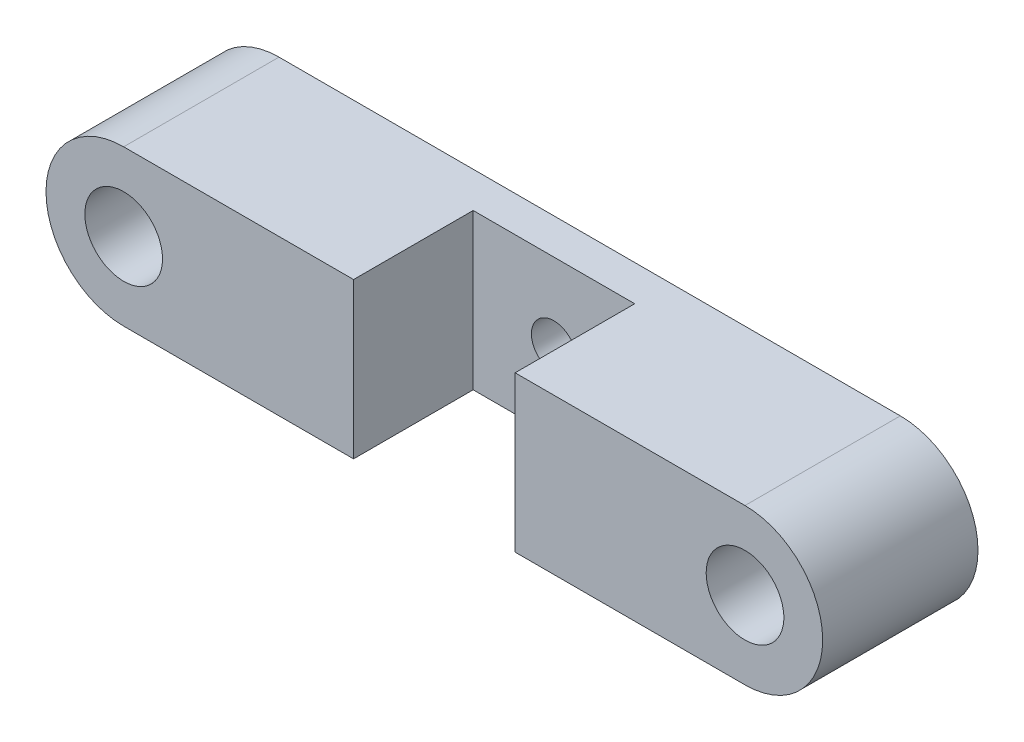
ISO-10303-21;
HEADER;
FILE_DESCRIPTION(('STEP AP214'),'2;1');
FILE_NAME('part.step','',(''),(''),'','','');
FILE_SCHEMA(('AUTOMOTIVE_DESIGN { 1 0 10303 214 1 1 1 1 }'));
ENDSEC;
DATA;
#1=APPLICATION_CONTEXT('core data for automotive mechanical design processes');
#2=APPLICATION_PROTOCOL_DEFINITION('international standard','automotive_design',2000,#1);
#3=PRODUCT_CONTEXT('',#1,'mechanical');
#4=PRODUCT('Part','Part','',(#3));
#5=PRODUCT_RELATED_PRODUCT_CATEGORY('part','',(#4));
#6=PRODUCT_DEFINITION_FORMATION('','',#4);
#7=PRODUCT_DEFINITION_CONTEXT('part definition',#1,'design');
#8=PRODUCT_DEFINITION('design','',#6,#7);
#9=PRODUCT_DEFINITION_SHAPE('','',#8);
#10=(LENGTH_UNIT() NAMED_UNIT(*) SI_UNIT(.MILLI.,.METRE.));
#11=(NAMED_UNIT(*) PLANE_ANGLE_UNIT() SI_UNIT($,.RADIAN.));
#12=(NAMED_UNIT(*) SI_UNIT($,.STERADIAN.) SOLID_ANGLE_UNIT());
#13=UNCERTAINTY_MEASURE_WITH_UNIT(LENGTH_MEASURE(1.E-05),#10,'distance_accuracy_value','');
#14=(GEOMETRIC_REPRESENTATION_CONTEXT(3) GLOBAL_UNCERTAINTY_ASSIGNED_CONTEXT((#13)) GLOBAL_UNIT_ASSIGNED_CONTEXT((#10,
#11,#12)) REPRESENTATION_CONTEXT('',''));
#15=CARTESIAN_POINT('',(0.,0.,0.));
#16=DIRECTION('',(0.,0.,1.));
#17=DIRECTION('',(1.,0.,0.));
#18=AXIS2_PLACEMENT_3D('',#15,#16,#17);
#19=CARTESIAN_POINT('',(-50.8,0.,25.4));
#20=DIRECTION('',(0.,0.,1.));
#21=DIRECTION('',(1.,0.,0.));
#22=AXIS2_PLACEMENT_3D('',#19,#20,#21);
#23=PLANE('',#22);
#24=DIRECTION('',(0.,1.,0.));
#25=VECTOR('',#24,1.);
#26=CARTESIAN_POINT('',(13.208,0.,25.4));
#27=LINE('',#26,#25);
#28=CARTESIAN_POINT('',(13.208,-12.7,25.4));
#29=VERTEX_POINT('',#28);
#30=CARTESIAN_POINT('',(13.208,12.7,25.4));
#31=VERTEX_POINT('',#30);
#32=EDGE_CURVE('E138',#29,#31,#27,.T.);
#33=ORIENTED_EDGE('',*,*,#32,.F.);
#34=DIRECTION('',(1.,0.,0.));
#35=VECTOR('',#34,1.);
#36=CARTESIAN_POINT('',(-50.8,-12.7,25.4));
#37=LINE('',#36,#35);
#38=CARTESIAN_POINT('',(50.8,-12.7,25.4));
#39=VERTEX_POINT('',#38);
#40=EDGE_CURVE('E155',#29,#39,#37,.T.);
#41=ORIENTED_EDGE('',*,*,#40,.T.);
#42=CARTESIAN_POINT('',(50.8,0.,25.4));
#43=DIRECTION('',(0.,0.,1.));
#44=DIRECTION('',(1.,0.,0.));
#45=AXIS2_PLACEMENT_3D('',#42,#43,#44);
#46=CIRCLE('',#45,12.7);
#47=CARTESIAN_POINT('',(50.8,12.7,25.4));
#48=VERTEX_POINT('',#47);
#49=EDGE_CURVE('E157',#39,#48,#46,.T.);
#50=ORIENTED_EDGE('',*,*,#49,.T.);
#51=DIRECTION('',(-1.,0.,0.));
#52=VECTOR('',#51,1.);
#53=CARTESIAN_POINT('',(-50.8,12.7,25.4));
#54=LINE('',#53,#52);
#55=EDGE_CURVE('E159',#48,#31,#54,.T.);
#56=ORIENTED_EDGE('',*,*,#55,.T.);
#57=EDGE_LOOP('',(#33,#41,#50,#56));
#58=FACE_BOUND('',#57,.T.);
#59=CARTESIAN_POINT('',(50.8,0.,25.4));
#60=DIRECTION('',(0.,0.,1.));
#61=DIRECTION('',(-1.,0.,0.));
#62=AXIS2_PLACEMENT_3D('',#59,#60,#61);
#63=CIRCLE('',#62,6.35);
#64=CARTESIAN_POINT('',(44.45,0.,25.4));
#65=VERTEX_POINT('',#64);
#66=EDGE_CURVE('E141',#65,#65,#63,.T.);
#67=ORIENTED_EDGE('',*,*,#66,.F.);
#68=EDGE_LOOP('',(#67));
#69=FACE_BOUND('',#68,.T.);
#70=ADVANCED_FACE('F33',(#58,#69),#23,.T.);
#71=DIRECTION('',(0.,-1.,0.));
#72=VECTOR('',#71,1.);
#73=CARTESIAN_POINT('',(-13.208,0.,25.4));
#74=LINE('',#73,#72);
#75=CARTESIAN_POINT('',(-13.208,12.7,25.4));
#76=VERTEX_POINT('',#75);
#77=CARTESIAN_POINT('',(-13.208,-12.7,25.4));
#78=VERTEX_POINT('',#77);
#79=EDGE_CURVE('E122',#76,#78,#74,.T.);
#80=ORIENTED_EDGE('',*,*,#79,.F.);
#81=CARTESIAN_POINT('',(-50.8,12.7,25.4));
#82=VERTEX_POINT('',#81);
#83=EDGE_CURVE('E57',#76,#82,#54,.T.);
#84=ORIENTED_EDGE('',*,*,#83,.T.);
#85=CARTESIAN_POINT('',(-50.8,0.,25.4));
#86=DIRECTION('',(0.,0.,1.));
#87=DIRECTION('',(1.,0.,0.));
#88=AXIS2_PLACEMENT_3D('',#85,#86,#87);
#89=CIRCLE('',#88,12.7);
#90=CARTESIAN_POINT('',(-50.8,-12.7,25.4));
#91=VERTEX_POINT('',#90);
#92=EDGE_CURVE('E153',#82,#91,#89,.T.);
#93=ORIENTED_EDGE('',*,*,#92,.T.);
#94=EDGE_CURVE('E87',#91,#78,#37,.T.);
#95=ORIENTED_EDGE('',*,*,#94,.T.);
#96=EDGE_LOOP('',(#80,#84,#93,#95));
#97=FACE_BOUND('',#96,.T.);
#98=CARTESIAN_POINT('',(-50.8,0.,25.4));
#99=DIRECTION('',(0.,0.,1.));
#100=DIRECTION('',(1.,0.,0.));
#101=AXIS2_PLACEMENT_3D('',#98,#99,#100);
#102=CIRCLE('',#101,6.35);
#103=CARTESIAN_POINT('',(-44.45,0.,25.4));
#104=VERTEX_POINT('',#103);
#105=EDGE_CURVE('E147',#104,#104,#102,.T.);
#106=ORIENTED_EDGE('',*,*,#105,.F.);
#107=EDGE_LOOP('',(#106));
#108=FACE_BOUND('',#107,.T.);
#109=ADVANCED_FACE('F195',(#97,#108),#23,.T.);
#110=CARTESIAN_POINT('',(-50.8,0.,0.));
#111=DIRECTION('',(0.,0.,1.));
#112=DIRECTION('',(1.,0.,0.));
#113=AXIS2_PLACEMENT_3D('',#110,#111,#112);
#114=PLANE('',#113);
#115=CARTESIAN_POINT('',(0.,0.,0.));
#116=DIRECTION('',(0.,0.,1.));
#117=DIRECTION('',(1.,0.,0.));
#118=AXIS2_PLACEMENT_3D('',#115,#116,#117);
#119=CIRCLE('',#118,3.683);
#120=CARTESIAN_POINT('',(3.683,0.,0.));
#121=VERTEX_POINT('',#120);
#122=EDGE_CURVE('E134',#121,#121,#119,.T.);
#123=ORIENTED_EDGE('',*,*,#122,.T.);
#124=EDGE_LOOP('',(#123));
#125=FACE_BOUND('',#124,.T.);
#126=CARTESIAN_POINT('',(-50.8,0.,0.));
#127=DIRECTION('',(0.,0.,1.));
#128=DIRECTION('',(1.,0.,0.));
#129=AXIS2_PLACEMENT_3D('',#126,#127,#128);
#130=CIRCLE('',#129,12.7);
#131=CARTESIAN_POINT('',(-50.8,12.7,0.));
#132=VERTEX_POINT('',#131);
#133=CARTESIAN_POINT('',(-50.8,-12.7,0.));
#134=VERTEX_POINT('',#133);
#135=EDGE_CURVE('E150',#132,#134,#130,.T.);
#136=ORIENTED_EDGE('',*,*,#135,.F.);
#137=DIRECTION('',(-1.,0.,0.));
#138=VECTOR('',#137,1.);
#139=CARTESIAN_POINT('',(-50.8,12.7,0.));
#140=LINE('',#139,#138);
#141=CARTESIAN_POINT('',(50.8,12.7,0.));
#142=VERTEX_POINT('',#141);
#143=EDGE_CURVE('E79',#142,#132,#140,.T.);
#144=ORIENTED_EDGE('',*,*,#143,.F.);
#145=CARTESIAN_POINT('',(50.8,0.,0.));
#146=DIRECTION('',(0.,0.,1.));
#147=DIRECTION('',(1.,0.,0.));
#148=AXIS2_PLACEMENT_3D('',#145,#146,#147);
#149=CIRCLE('',#148,12.7);
#150=CARTESIAN_POINT('',(50.8,-12.7,0.));
#151=VERTEX_POINT('',#150);
#152=EDGE_CURVE('E167',#151,#142,#149,.T.);
#153=ORIENTED_EDGE('',*,*,#152,.F.);
#154=DIRECTION('',(1.,0.,0.));
#155=VECTOR('',#154,1.);
#156=CARTESIAN_POINT('',(-50.8,-12.7,0.));
#157=LINE('',#156,#155);
#158=EDGE_CURVE('E165',#134,#151,#157,.T.);
#159=ORIENTED_EDGE('',*,*,#158,.F.);
#160=EDGE_LOOP('',(#136,#144,#153,#159));
#161=FACE_BOUND('',#160,.T.);
#162=CARTESIAN_POINT('',(-50.8,0.,0.));
#163=DIRECTION('',(0.,0.,1.));
#164=DIRECTION('',(1.,0.,0.));
#165=AXIS2_PLACEMENT_3D('',#162,#163,#164);
#166=CIRCLE('',#165,6.35);
#167=CARTESIAN_POINT('',(-44.45,0.,0.));
#168=VERTEX_POINT('',#167);
#169=EDGE_CURVE('E144',#168,#168,#166,.T.);
#170=ORIENTED_EDGE('',*,*,#169,.T.);
#171=EDGE_LOOP('',(#170));
#172=FACE_BOUND('',#171,.T.);
#173=CARTESIAN_POINT('',(50.8,0.,0.));
#174=DIRECTION('',(0.,0.,1.));
#175=DIRECTION('',(-1.,0.,0.));
#176=AXIS2_PLACEMENT_3D('',#173,#174,#175);
#177=CIRCLE('',#176,6.35);
#178=CARTESIAN_POINT('',(44.45,0.,0.));
#179=VERTEX_POINT('',#178);
#180=EDGE_CURVE('E140',#179,#179,#177,.T.);
#181=ORIENTED_EDGE('',*,*,#180,.T.);
#182=EDGE_LOOP('',(#181));
#183=FACE_BOUND('',#182,.T.);
#184=ADVANCED_FACE('F181',(#125,#161,#172,#183),#114,.F.);
#185=CARTESIAN_POINT('',(-50.8,0.,25.4));
#186=DIRECTION('',(0.,0.,-1.));
#187=DIRECTION('',(-1.,0.,0.));
#188=AXIS2_PLACEMENT_3D('',#185,#186,#187);
#189=CYLINDRICAL_SURFACE('',#188,12.7);
#190=ORIENTED_EDGE('',*,*,#135,.T.);
#191=DIRECTION('',(0.,0.,-1.));
#192=VECTOR('',#191,1.);
#193=CARTESIAN_POINT('',(-50.8,-12.7,25.4));
#194=LINE('',#193,#192);
#195=EDGE_CURVE('E41',#91,#134,#194,.T.);
#196=ORIENTED_EDGE('',*,*,#195,.F.);
#197=ORIENTED_EDGE('',*,*,#92,.F.);
#198=DIRECTION('',(0.,0.,-1.));
#199=VECTOR('',#198,1.);
#200=CARTESIAN_POINT('',(-50.8,12.7,25.4));
#201=LINE('',#200,#199);
#202=EDGE_CURVE('E162',#82,#132,#201,.T.);
#203=ORIENTED_EDGE('',*,*,#202,.T.);
#204=EDGE_LOOP('',(#190,#196,#197,#203));
#205=FACE_BOUND('',#204,.T.);
#206=ADVANCED_FACE('F35',(#205),#189,.T.);
#207=CARTESIAN_POINT('',(-50.8,-12.7,25.4));
#208=DIRECTION('',(0.,1.,0.));
#209=DIRECTION('',(-1.,0.,0.));
#210=AXIS2_PLACEMENT_3D('',#207,#208,#209);
#211=PLANE('',#210);
#212=ORIENTED_EDGE('',*,*,#40,.F.);
#213=DIRECTION('',(0.,0.,-1.));
#214=VECTOR('',#213,1.);
#215=CARTESIAN_POINT('',(13.208,-12.7,5.842));
#216=LINE('',#215,#214);
#217=CARTESIAN_POINT('',(13.208,-12.7,5.842));
#218=VERTEX_POINT('',#217);
#219=EDGE_CURVE('E118',#29,#218,#216,.T.);
#220=ORIENTED_EDGE('',*,*,#219,.T.);
#221=DIRECTION('',(-1.,0.,0.));
#222=VECTOR('',#221,1.);
#223=CARTESIAN_POINT('',(-13.208,-12.7,5.842));
#224=LINE('',#223,#222);
#225=CARTESIAN_POINT('',(-13.208,-12.7,5.842));
#226=VERTEX_POINT('',#225);
#227=EDGE_CURVE('E113',#218,#226,#224,.T.);
#228=ORIENTED_EDGE('',*,*,#227,.T.);
#229=DIRECTION('',(0.,0.,1.));
#230=VECTOR('',#229,1.);
#231=CARTESIAN_POINT('',(-13.208,-12.7,5.842));
#232=LINE('',#231,#230);
#233=EDGE_CURVE('E120',#226,#78,#232,.T.);
#234=ORIENTED_EDGE('',*,*,#233,.T.);
#235=ORIENTED_EDGE('',*,*,#94,.F.);
#236=ORIENTED_EDGE('',*,*,#195,.T.);
#237=ORIENTED_EDGE('',*,*,#158,.T.);
#238=DIRECTION('',(0.,0.,-1.));
#239=VECTOR('',#238,1.);
#240=CARTESIAN_POINT('',(50.8,-12.7,25.4));
#241=LINE('',#240,#239);
#242=EDGE_CURVE('E173',#39,#151,#241,.T.);
#243=ORIENTED_EDGE('',*,*,#242,.F.);
#244=EDGE_LOOP('',(#212,#220,#228,#234,#235,#236,#237,#243));
#245=FACE_BOUND('',#244,.T.);
#246=ADVANCED_FACE('F125',(#245),#211,.F.);
#247=CARTESIAN_POINT('',(50.8,0.,25.4));
#248=DIRECTION('',(0.,0.,-1.));
#249=DIRECTION('',(-1.,0.,0.));
#250=AXIS2_PLACEMENT_3D('',#247,#248,#249);
#251=CYLINDRICAL_SURFACE('',#250,12.7);
#252=ORIENTED_EDGE('',*,*,#152,.T.);
#253=DIRECTION('',(0.,0.,-1.));
#254=VECTOR('',#253,1.);
#255=CARTESIAN_POINT('',(50.8,12.7,25.4));
#256=LINE('',#255,#254);
#257=EDGE_CURVE('E171',#48,#142,#256,.T.);
#258=ORIENTED_EDGE('',*,*,#257,.F.);
#259=ORIENTED_EDGE('',*,*,#49,.F.);
#260=ORIENTED_EDGE('',*,*,#242,.T.);
#261=EDGE_LOOP('',(#252,#258,#259,#260));
#262=FACE_BOUND('',#261,.T.);
#263=ADVANCED_FACE('F186',(#262),#251,.T.);
#264=CARTESIAN_POINT('',(-50.8,12.7,25.4));
#265=DIRECTION('',(0.,-1.,0.));
#266=DIRECTION('',(1.,0.,0.));
#267=AXIS2_PLACEMENT_3D('',#264,#265,#266);
#268=PLANE('',#267);
#269=DIRECTION('',(-1.,0.,0.));
#270=VECTOR('',#269,1.);
#271=CARTESIAN_POINT('',(-13.208,12.7,5.842));
#272=LINE('',#271,#270);
#273=CARTESIAN_POINT('',(13.208,12.7,5.842));
#274=VERTEX_POINT('',#273);
#275=CARTESIAN_POINT('',(-13.208,12.7,5.842));
#276=VERTEX_POINT('',#275);
#277=EDGE_CURVE('E48',#274,#276,#272,.T.);
#278=ORIENTED_EDGE('',*,*,#277,.F.);
#279=DIRECTION('',(0.,0.,1.));
#280=VECTOR('',#279,1.);
#281=CARTESIAN_POINT('',(13.208,12.7,25.4));
#282=LINE('',#281,#280);
#283=EDGE_CURVE('E11',#274,#31,#282,.T.);
#284=ORIENTED_EDGE('',*,*,#283,.T.);
#285=ORIENTED_EDGE('',*,*,#55,.F.);
#286=ORIENTED_EDGE('',*,*,#257,.T.);
#287=ORIENTED_EDGE('',*,*,#143,.T.);
#288=ORIENTED_EDGE('',*,*,#202,.F.);
#289=ORIENTED_EDGE('',*,*,#83,.F.);
#290=DIRECTION('',(0.,0.,1.));
#291=VECTOR('',#290,1.);
#292=CARTESIAN_POINT('',(-13.208,12.7,5.842));
#293=LINE('',#292,#291);
#294=EDGE_CURVE('E126',#276,#76,#293,.T.);
#295=ORIENTED_EDGE('',*,*,#294,.F.);
#296=EDGE_LOOP('',(#278,#284,#285,#286,#287,#288,#289,#295));
#297=FACE_BOUND('',#296,.T.);
#298=ADVANCED_FACE('F189',(#297),#268,.F.);
#299=CARTESIAN_POINT('',(-50.8,0.,25.4));
#300=DIRECTION('',(0.,0.,-1.));
#301=DIRECTION('',(-1.,0.,0.));
#302=AXIS2_PLACEMENT_3D('',#299,#300,#301);
#303=CYLINDRICAL_SURFACE('',#302,6.35);
#304=ORIENTED_EDGE('',*,*,#105,.T.);
#305=EDGE_LOOP('',(#304));
#306=FACE_BOUND('',#305,.T.);
#307=ORIENTED_EDGE('',*,*,#169,.F.);
#308=EDGE_LOOP('',(#307));
#309=FACE_BOUND('',#308,.T.);
#310=ADVANCED_FACE('F201',(#306,#309),#303,.F.);
#311=CARTESIAN_POINT('',(50.8,0.,25.4));
#312=DIRECTION('',(0.,0.,-1.));
#313=DIRECTION('',(-1.,0.,0.));
#314=AXIS2_PLACEMENT_3D('',#311,#312,#313);
#315=CYLINDRICAL_SURFACE('',#314,6.35);
#316=ORIENTED_EDGE('',*,*,#66,.T.);
#317=EDGE_LOOP('',(#316));
#318=FACE_BOUND('',#317,.T.);
#319=ORIENTED_EDGE('',*,*,#180,.F.);
#320=EDGE_LOOP('',(#319));
#321=FACE_BOUND('',#320,.T.);
#322=ADVANCED_FACE('F204',(#318,#321),#315,.F.);
#323=CARTESIAN_POINT('',(-13.208,-12.7,5.842));
#324=DIRECTION('',(0.,0.,-1.));
#325=DIRECTION('',(-1.,0.,0.));
#326=AXIS2_PLACEMENT_3D('',#323,#324,#325);
#327=PLANE('',#326);
#328=CARTESIAN_POINT('',(0.,0.,5.842));
#329=DIRECTION('',(0.,0.,1.));
#330=DIRECTION('',(1.,0.,0.));
#331=AXIS2_PLACEMENT_3D('',#328,#329,#330);
#332=CIRCLE('',#331,3.683);
#333=CARTESIAN_POINT('',(3.683,0.,5.842));
#334=VERTEX_POINT('',#333);
#335=EDGE_CURVE('E130',#334,#334,#332,.T.);
#336=ORIENTED_EDGE('',*,*,#335,.F.);
#337=EDGE_LOOP('',(#336));
#338=FACE_BOUND('',#337,.T.);
#339=ORIENTED_EDGE('',*,*,#277,.T.);
#340=DIRECTION('',(0.,1.,0.));
#341=VECTOR('',#340,1.);
#342=CARTESIAN_POINT('',(-13.208,-12.7,5.842));
#343=LINE('',#342,#341);
#344=EDGE_CURVE('E109',#226,#276,#343,.T.);
#345=ORIENTED_EDGE('',*,*,#344,.F.);
#346=ORIENTED_EDGE('',*,*,#227,.F.);
#347=DIRECTION('',(0.,1.,0.));
#348=VECTOR('',#347,1.);
#349=CARTESIAN_POINT('',(13.208,-12.7,5.842));
#350=LINE('',#349,#348);
#351=EDGE_CURVE('E117',#218,#274,#350,.T.);
#352=ORIENTED_EDGE('',*,*,#351,.T.);
#353=EDGE_LOOP('',(#339,#345,#346,#352));
#354=FACE_BOUND('',#353,.T.);
#355=ADVANCED_FACE('F111',(#338,#354),#327,.F.);
#356=CARTESIAN_POINT('',(13.208,-12.7,5.842));
#357=DIRECTION('',(1.,0.,0.));
#358=DIRECTION('',(0.,0.,-1.));
#359=AXIS2_PLACEMENT_3D('',#356,#357,#358);
#360=PLANE('',#359);
#361=ORIENTED_EDGE('',*,*,#32,.T.);
#362=ORIENTED_EDGE('',*,*,#283,.F.);
#363=ORIENTED_EDGE('',*,*,#351,.F.);
#364=ORIENTED_EDGE('',*,*,#219,.F.);
#365=EDGE_LOOP('',(#361,#362,#363,#364));
#366=FACE_BOUND('',#365,.T.);
#367=ADVANCED_FACE('F194',(#366),#360,.F.);
#368=CARTESIAN_POINT('',(-13.208,-12.7,5.842));
#369=DIRECTION('',(-1.,0.,0.));
#370=DIRECTION('',(0.,0.,1.));
#371=AXIS2_PLACEMENT_3D('',#368,#369,#370);
#372=PLANE('',#371);
#373=ORIENTED_EDGE('',*,*,#79,.T.);
#374=ORIENTED_EDGE('',*,*,#233,.F.);
#375=ORIENTED_EDGE('',*,*,#344,.T.);
#376=ORIENTED_EDGE('',*,*,#294,.T.);
#377=EDGE_LOOP('',(#373,#374,#375,#376));
#378=FACE_BOUND('',#377,.T.);
#379=ADVANCED_FACE('F121',(#378),#372,.F.);
#380=CARTESIAN_POINT('',(0.,0.,0.));
#381=DIRECTION('',(0.,0.,1.));
#382=DIRECTION('',(1.,0.,0.));
#383=AXIS2_PLACEMENT_3D('',#380,#381,#382);
#384=CYLINDRICAL_SURFACE('',#383,3.683);
#385=ORIENTED_EDGE('',*,*,#122,.F.);
#386=EDGE_LOOP('',(#385));
#387=FACE_BOUND('',#386,.T.);
#388=ORIENTED_EDGE('',*,*,#335,.T.);
#389=EDGE_LOOP('',(#388));
#390=FACE_BOUND('',#389,.T.);
#391=ADVANCED_FACE('F275',(#387,#390),#384,.F.);
#392=CLOSED_SHELL('',(#70,#109,#184,#206,#246,#263,#298,#310,#322,#355,#367,#379,#391));
#393=MANIFOLD_SOLID_BREP('B2',#392);
#394=ADVANCED_BREP_SHAPE_REPRESENTATION('',(#18,#393),#14);
#395=SHAPE_DEFINITION_REPRESENTATION(#9,#394);
ENDSEC;
END-ISO-10303-21;
